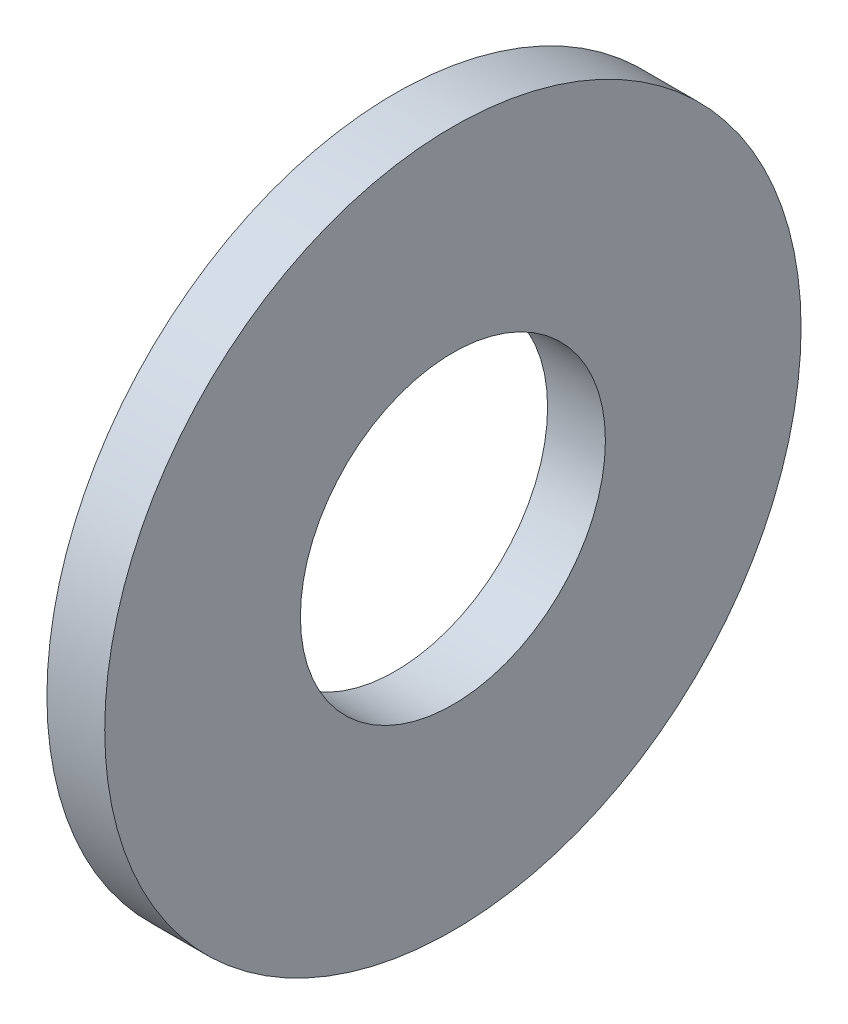
ISO-10303-21;
HEADER;
FILE_DESCRIPTION(('STEP AP214'),'2;1');
FILE_NAME('part.step','',(''),(''),'','','');
FILE_SCHEMA(('AUTOMOTIVE_DESIGN { 1 0 10303 214 1 1 1 1 }'));
ENDSEC;
DATA;
#1=APPLICATION_CONTEXT('core data for automotive mechanical design processes');
#2=APPLICATION_PROTOCOL_DEFINITION('international standard','automotive_design',2000,#1);
#3=PRODUCT_CONTEXT('',#1,'mechanical');
#4=PRODUCT('Part','Part','',(#3));
#5=PRODUCT_RELATED_PRODUCT_CATEGORY('part','',(#4));
#6=PRODUCT_DEFINITION_FORMATION('','',#4);
#7=PRODUCT_DEFINITION_CONTEXT('part definition',#1,'design');
#8=PRODUCT_DEFINITION('design','',#6,#7);
#9=PRODUCT_DEFINITION_SHAPE('','',#8);
#10=(LENGTH_UNIT() NAMED_UNIT(*) SI_UNIT(.MILLI.,.METRE.));
#11=(NAMED_UNIT(*) PLANE_ANGLE_UNIT() SI_UNIT($,.RADIAN.));
#12=(NAMED_UNIT(*) SI_UNIT($,.STERADIAN.) SOLID_ANGLE_UNIT());
#13=UNCERTAINTY_MEASURE_WITH_UNIT(LENGTH_MEASURE(1.E-05),#10,'distance_accuracy_value','');
#14=(GEOMETRIC_REPRESENTATION_CONTEXT(3) GLOBAL_UNCERTAINTY_ASSIGNED_CONTEXT((#13)) GLOBAL_UNIT_ASSIGNED_CONTEXT((#10,
#11,#12)) REPRESENTATION_CONTEXT('',''));
#15=CARTESIAN_POINT('',(0.,0.,0.));
#16=DIRECTION('',(0.,0.,1.));
#17=DIRECTION('',(1.,0.,0.));
#18=AXIS2_PLACEMENT_3D('',#15,#16,#17);
#19=CARTESIAN_POINT('',(-34.925,0.,0.));
#20=DIRECTION('',(-1.,0.,0.));
#21=DIRECTION('',(0.,0.,1.));
#22=AXIS2_PLACEMENT_3D('',#19,#20,#21);
#23=CYLINDRICAL_SURFACE('',#22,5.5626);
#24=CARTESIAN_POINT('',(0.,0.,0.));
#25=DIRECTION('',(-1.,0.,0.));
#26=DIRECTION('',(0.,0.,1.));
#27=AXIS2_PLACEMENT_3D('',#24,#25,#26);
#28=CIRCLE('',#27,5.5626);
#29=CARTESIAN_POINT('',(0.,0.,5.5626));
#30=VERTEX_POINT('',#29);
#31=EDGE_CURVE('E10',#30,#30,#28,.T.);
#32=ORIENTED_EDGE('',*,*,#31,.F.);
#33=EDGE_LOOP('',(#32));
#34=FACE_BOUND('',#33,.T.);
#35=CARTESIAN_POINT('',(-2.1082,0.,0.));
#36=DIRECTION('',(-1.,0.,0.));
#37=DIRECTION('',(0.,0.,1.));
#38=AXIS2_PLACEMENT_3D('',#35,#36,#37);
#39=CIRCLE('',#38,5.5626);
#40=CARTESIAN_POINT('',(-2.1082,0.,5.5626));
#41=VERTEX_POINT('',#40);
#42=EDGE_CURVE('E29',#41,#41,#39,.T.);
#43=ORIENTED_EDGE('',*,*,#42,.T.);
#44=EDGE_LOOP('',(#43));
#45=FACE_BOUND('',#44,.T.);
#46=ADVANCED_FACE('F15',(#34,#45),#23,.F.);
#47=CARTESIAN_POINT('',(0.,5.5626,0.));
#48=DIRECTION('',(-1.,0.,0.));
#49=DIRECTION('',(0.,0.,1.));
#50=AXIS2_PLACEMENT_3D('',#47,#48,#49);
#51=PLANE('',#50);
#52=CARTESIAN_POINT('',(0.,0.,0.));
#53=DIRECTION('',(-1.,0.,0.));
#54=DIRECTION('',(0.,0.,1.));
#55=AXIS2_PLACEMENT_3D('',#52,#53,#54);
#56=CIRCLE('',#55,12.7);
#57=CARTESIAN_POINT('',(0.,0.,12.7));
#58=VERTEX_POINT('',#57);
#59=EDGE_CURVE('E21',#58,#58,#56,.T.);
#60=ORIENTED_EDGE('',*,*,#59,.F.);
#61=EDGE_LOOP('',(#60));
#62=FACE_BOUND('',#61,.T.);
#63=ORIENTED_EDGE('',*,*,#31,.T.);
#64=EDGE_LOOP('',(#63));
#65=FACE_BOUND('',#64,.T.);
#66=ADVANCED_FACE('F44',(#62,#65),#51,.F.);
#67=CARTESIAN_POINT('',(-34.925,0.,0.));
#68=DIRECTION('',(-1.,0.,0.));
#69=DIRECTION('',(0.,0.,1.));
#70=AXIS2_PLACEMENT_3D('',#67,#68,#69);
#71=CYLINDRICAL_SURFACE('',#70,12.7);
#72=CARTESIAN_POINT('',(-2.1082,0.,0.));
#73=DIRECTION('',(-1.,0.,0.));
#74=DIRECTION('',(0.,0.,1.));
#75=AXIS2_PLACEMENT_3D('',#72,#73,#74);
#76=CIRCLE('',#75,12.7);
#77=CARTESIAN_POINT('',(-2.1082,0.,12.7));
#78=VERTEX_POINT('',#77);
#79=EDGE_CURVE('E25',#78,#78,#76,.T.);
#80=ORIENTED_EDGE('',*,*,#79,.F.);
#81=EDGE_LOOP('',(#80));
#82=FACE_BOUND('',#81,.T.);
#83=ORIENTED_EDGE('',*,*,#59,.T.);
#84=EDGE_LOOP('',(#83));
#85=FACE_BOUND('',#84,.T.);
#86=ADVANCED_FACE('F39',(#82,#85),#71,.T.);
#87=CARTESIAN_POINT('',(-2.1082,12.7,0.));
#88=DIRECTION('',(1.,0.,0.));
#89=DIRECTION('',(0.,0.,-1.));
#90=AXIS2_PLACEMENT_3D('',#87,#88,#89);
#91=PLANE('',#90);
#92=ORIENTED_EDGE('',*,*,#42,.F.);
#93=EDGE_LOOP('',(#92));
#94=FACE_BOUND('',#93,.T.);
#95=ORIENTED_EDGE('',*,*,#79,.T.);
#96=EDGE_LOOP('',(#95));
#97=FACE_BOUND('',#96,.T.);
#98=ADVANCED_FACE('F36',(#94,#97),#91,.F.);
#99=CLOSED_SHELL('',(#46,#66,#86,#98));
#100=MANIFOLD_SOLID_BREP('B1',#99);
#101=ADVANCED_BREP_SHAPE_REPRESENTATION('',(#18,#100),#14);
#102=SHAPE_DEFINITION_REPRESENTATION(#9,#101);
ENDSEC;
END-ISO-10303-21;
